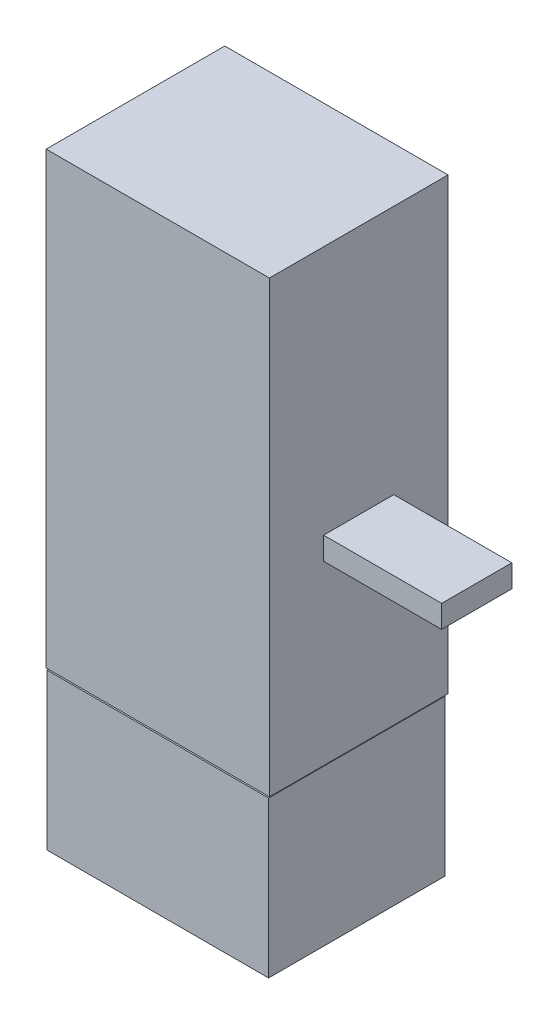
ISO-10303-21;
HEADER;
FILE_DESCRIPTION(('STEP AP214'),'2;1');
FILE_NAME('part.step','',(''),(''),'','','');
FILE_SCHEMA(('AUTOMOTIVE_DESIGN { 1 0 10303 214 1 1 1 1 }'));
ENDSEC;
DATA;
#1=APPLICATION_CONTEXT('core data for automotive mechanical design processes');
#2=APPLICATION_PROTOCOL_DEFINITION('international standard','automotive_design',2000,#1);
#3=PRODUCT_CONTEXT('',#1,'mechanical');
#4=PRODUCT('Part','Part','',(#3));
#5=PRODUCT_RELATED_PRODUCT_CATEGORY('part','',(#4));
#6=PRODUCT_DEFINITION_FORMATION('','',#4);
#7=PRODUCT_DEFINITION_CONTEXT('part definition',#1,'design');
#8=PRODUCT_DEFINITION('design','',#6,#7);
#9=PRODUCT_DEFINITION_SHAPE('','',#8);
#10=(LENGTH_UNIT() NAMED_UNIT(*) SI_UNIT(.MILLI.,.METRE.));
#11=(NAMED_UNIT(*) PLANE_ANGLE_UNIT() SI_UNIT($,.RADIAN.));
#12=(NAMED_UNIT(*) SI_UNIT($,.STERADIAN.) SOLID_ANGLE_UNIT());
#13=UNCERTAINTY_MEASURE_WITH_UNIT(LENGTH_MEASURE(1.E-05),#10,'distance_accuracy_value','');
#14=(GEOMETRIC_REPRESENTATION_CONTEXT(3) GLOBAL_UNCERTAINTY_ASSIGNED_CONTEXT((#13)) GLOBAL_UNIT_ASSIGNED_CONTEXT((#10,
#11,#12)) REPRESENTATION_CONTEXT('',''));
#15=CARTESIAN_POINT('',(0.,0.,0.));
#16=DIRECTION('',(0.,0.,1.));
#17=DIRECTION('',(1.,0.,0.));
#18=AXIS2_PLACEMENT_3D('',#15,#16,#17);
#19=CARTESIAN_POINT('',(747.965698242188,1133.51440429688,4609.51050721351));
#20=DIRECTION('',(-1.,0.,0.));
#21=DIRECTION('',(0.,0.,1.));
#22=AXIS2_PLACEMENT_3D('',#19,#20,#21);
#23=PLANE('',#22);
#24=DIRECTION('',(0.,0.,-1.));
#25=VECTOR('',#24,1.);
#26=CARTESIAN_POINT('',(747.965698242188,1133.51440429688,4609.51050721351));
#27=LINE('',#26,#25);
#28=CARTESIAN_POINT('',(747.965698242188,1133.51440429688,2390.));
#29=VERTEX_POINT('',#28);
#30=CARTESIAN_POINT('',(747.965698242188,1133.51440429688,1599.94));
#31=VERTEX_POINT('',#30);
#32=EDGE_CURVE('E181',#29,#31,#27,.T.);
#33=ORIENTED_EDGE('',*,*,#32,.F.);
#34=DIRECTION('',(0.,-1.,0.));
#35=VECTOR('',#34,1.);
#36=CARTESIAN_POINT('',(747.965698242188,1133.51440429688,2390.));
#37=LINE('',#36,#35);
#38=CARTESIAN_POINT('',(747.965698242188,-854.139282226562,2390.));
#39=VERTEX_POINT('',#38);
#40=EDGE_CURVE('E156',#29,#39,#37,.T.);
#41=ORIENTED_EDGE('',*,*,#40,.T.);
#42=DIRECTION('',(0.,0.,-1.));
#43=VECTOR('',#42,1.);
#44=CARTESIAN_POINT('',(747.965698242188,-854.139282226562,4609.51050721351));
#45=LINE('',#44,#43);
#46=CARTESIAN_POINT('',(747.965698242188,-854.139282226562,1599.94));
#47=VERTEX_POINT('',#46);
#48=EDGE_CURVE('E172',#39,#47,#45,.T.);
#49=ORIENTED_EDGE('',*,*,#48,.T.);
#50=DIRECTION('',(0.,1.,0.));
#51=VECTOR('',#50,1.);
#52=CARTESIAN_POINT('',(747.965698242188,1133.51440429688,1599.94));
#53=LINE('',#52,#51);
#54=EDGE_CURVE('E136',#47,#31,#53,.T.);
#55=ORIENTED_EDGE('',*,*,#54,.T.);
#56=EDGE_LOOP('',(#33,#41,#49,#55));
#57=FACE_BOUND('',#56,.T.);
#58=DIRECTION('',(0.,-1.,0.));
#59=VECTOR('',#58,1.);
#60=CARTESIAN_POINT('',(747.965698242188,1133.51440429688,2150.33762460566));
#61=LINE('',#60,#59);
#62=CARTESIAN_POINT('',(747.965698242188,28.5106049636239,2150.33762460566));
#63=VERTEX_POINT('',#62);
#64=CARTESIAN_POINT('',(747.965698242188,-71.3554303362016,2150.33762460566));
#65=VERTEX_POINT('',#64);
#66=EDGE_CURVE('E12',#63,#65,#61,.T.);
#67=ORIENTED_EDGE('',*,*,#66,.F.);
#68=DIRECTION('',(0.,0.,1.));
#69=VECTOR('',#68,1.);
#70=CARTESIAN_POINT('',(747.965698242188,28.5106049636239,4609.51050721351));
#71=LINE('',#70,#69);
#72=CARTESIAN_POINT('',(747.965698242188,28.5106049636239,1839.88451486924));
#73=VERTEX_POINT('',#72);
#74=EDGE_CURVE('E159',#73,#63,#71,.T.);
#75=ORIENTED_EDGE('',*,*,#74,.F.);
#76=DIRECTION('',(0.,1.,0.));
#77=VECTOR('',#76,1.);
#78=CARTESIAN_POINT('',(747.965698242188,1133.51440429688,1839.88451486924));
#79=LINE('',#78,#77);
#80=CARTESIAN_POINT('',(747.965698242188,-71.3554303362016,1839.88451486924));
#81=VERTEX_POINT('',#80);
#82=EDGE_CURVE('E69',#81,#73,#79,.T.);
#83=ORIENTED_EDGE('',*,*,#82,.F.);
#84=DIRECTION('',(0.,0.,-1.));
#85=VECTOR('',#84,1.);
#86=CARTESIAN_POINT('',(747.965698242188,-71.3554303362016,4609.51050721351));
#87=LINE('',#86,#85);
#88=EDGE_CURVE('E59',#65,#81,#87,.T.);
#89=ORIENTED_EDGE('',*,*,#88,.F.);
#90=EDGE_LOOP('',(#67,#75,#83,#89));
#91=FACE_BOUND('',#90,.T.);
#92=ADVANCED_FACE('F51',(#57,#91),#23,.F.);
#93=CARTESIAN_POINT('',(0.,0.,1599.94));
#94=DIRECTION('',(0.,0.,-1.));
#95=DIRECTION('',(-1.,0.,0.));
#96=AXIS2_PLACEMENT_3D('',#93,#94,#95);
#97=PLANE('',#96);
#98=ORIENTED_EDGE('',*,*,#54,.F.);
#99=DIRECTION('',(1.,0.,0.));
#100=VECTOR('',#99,1.);
#101=CARTESIAN_POINT('',(747.965698242188,-854.139282226562,1599.94));
#102=LINE('',#101,#100);
#103=CARTESIAN_POINT('',(-239.687942504883,-854.139282226562,1599.94));
#104=VERTEX_POINT('',#103);
#105=EDGE_CURVE('E168',#104,#47,#102,.T.);
#106=ORIENTED_EDGE('',*,*,#105,.F.);
#107=DIRECTION('',(0.,-1.,0.));
#108=VECTOR('',#107,1.);
#109=CARTESIAN_POINT('',(-239.687942504883,1133.51440429688,1599.94));
#110=LINE('',#109,#108);
#111=CARTESIAN_POINT('',(-239.687942504883,1133.51440429688,1599.94));
#112=VERTEX_POINT('',#111);
#113=EDGE_CURVE('E164',#112,#104,#110,.T.);
#114=ORIENTED_EDGE('',*,*,#113,.F.);
#115=DIRECTION('',(-1.,0.,0.));
#116=VECTOR('',#115,1.);
#117=CARTESIAN_POINT('',(747.965698242188,1133.51440429688,1599.94));
#118=LINE('',#117,#116);
#119=EDGE_CURVE('E141',#31,#112,#118,.T.);
#120=ORIENTED_EDGE('',*,*,#119,.F.);
#121=EDGE_LOOP('',(#98,#106,#114,#120));
#122=FACE_BOUND('',#121,.T.);
#123=ADVANCED_FACE('F207',(#122),#97,.T.);
#124=CARTESIAN_POINT('',(747.965698242188,-854.139282226562,4609.51050721351));
#125=DIRECTION('',(0.,1.,0.));
#126=DIRECTION('',(0.,0.,1.));
#127=AXIS2_PLACEMENT_3D('',#124,#125,#126);
#128=PLANE('',#127);
#129=ORIENTED_EDGE('',*,*,#48,.F.);
#130=DIRECTION('',(-1.,0.,0.));
#131=VECTOR('',#130,1.);
#132=CARTESIAN_POINT('',(747.965698242188,-854.139282226562,2390.));
#133=LINE('',#132,#131);
#134=CARTESIAN_POINT('',(-239.687942504883,-854.139282226562,2390.));
#135=VERTEX_POINT('',#134);
#136=EDGE_CURVE('E152',#39,#135,#133,.T.);
#137=ORIENTED_EDGE('',*,*,#136,.T.);
#138=DIRECTION('',(0.,0.,-1.));
#139=VECTOR('',#138,1.);
#140=CARTESIAN_POINT('',(-239.687942504883,-854.139282226562,4609.51050721351));
#141=LINE('',#140,#139);
#142=EDGE_CURVE('E175',#135,#104,#141,.T.);
#143=ORIENTED_EDGE('',*,*,#142,.T.);
#144=ORIENTED_EDGE('',*,*,#105,.T.);
#145=EDGE_LOOP('',(#129,#137,#143,#144));
#146=FACE_BOUND('',#145,.T.);
#147=ADVANCED_FACE('F214',(#146),#128,.F.);
#148=CARTESIAN_POINT('',(-239.687942504883,1133.51440429688,4609.51050721351));
#149=DIRECTION('',(1.,0.,0.));
#150=DIRECTION('',(0.,0.,-1.));
#151=AXIS2_PLACEMENT_3D('',#148,#149,#150);
#152=PLANE('',#151);
#153=ORIENTED_EDGE('',*,*,#142,.F.);
#154=DIRECTION('',(0.,1.,0.));
#155=VECTOR('',#154,1.);
#156=CARTESIAN_POINT('',(-239.687942504883,1133.51440429688,2390.));
#157=LINE('',#156,#155);
#158=CARTESIAN_POINT('',(-239.687942504883,1133.51440429688,2390.));
#159=VERTEX_POINT('',#158);
#160=EDGE_CURVE('E147',#135,#159,#157,.T.);
#161=ORIENTED_EDGE('',*,*,#160,.T.);
#162=DIRECTION('',(0.,0.,-1.));
#163=VECTOR('',#162,1.);
#164=CARTESIAN_POINT('',(-239.687942504883,1133.51440429688,4609.51050721351));
#165=LINE('',#164,#163);
#166=EDGE_CURVE('E178',#159,#112,#165,.T.);
#167=ORIENTED_EDGE('',*,*,#166,.T.);
#168=ORIENTED_EDGE('',*,*,#113,.T.);
#169=EDGE_LOOP('',(#153,#161,#167,#168));
#170=FACE_BOUND('',#169,.T.);
#171=ADVANCED_FACE('F231',(#170),#152,.F.);
#172=CARTESIAN_POINT('',(747.965698242188,1133.51440429688,4609.51050721351));
#173=DIRECTION('',(0.,-1.,0.));
#174=DIRECTION('',(0.,0.,-1.));
#175=AXIS2_PLACEMENT_3D('',#172,#173,#174);
#176=PLANE('',#175);
#177=ORIENTED_EDGE('',*,*,#166,.F.);
#178=DIRECTION('',(1.,0.,0.));
#179=VECTOR('',#178,1.);
#180=CARTESIAN_POINT('',(747.965698242188,1133.51440429688,2390.));
#181=LINE('',#180,#179);
#182=EDGE_CURVE('E151',#159,#29,#181,.T.);
#183=ORIENTED_EDGE('',*,*,#182,.T.);
#184=ORIENTED_EDGE('',*,*,#32,.T.);
#185=ORIENTED_EDGE('',*,*,#119,.T.);
#186=EDGE_LOOP('',(#177,#183,#184,#185));
#187=FACE_BOUND('',#186,.T.);
#188=ADVANCED_FACE('F223',(#187),#176,.F.);
#189=CARTESIAN_POINT('',(-235.861114501953,-860.69,2390.));
#190=DIRECTION('',(0.,0.,-1.));
#191=DIRECTION('',(-1.,0.,0.));
#192=AXIS2_PLACEMENT_3D('',#189,#190,#191);
#193=PLANE('',#192);
#194=ORIENTED_EDGE('',*,*,#182,.F.);
#195=ORIENTED_EDGE('',*,*,#160,.F.);
#196=ORIENTED_EDGE('',*,*,#136,.F.);
#197=ORIENTED_EDGE('',*,*,#40,.F.);
#198=EDGE_LOOP('',(#194,#195,#196,#197));
#199=FACE_BOUND('',#198,.T.);
#200=ADVANCED_FACE('F225',(#199),#193,.F.);
#201=CARTESIAN_POINT('',(1270.13891601562,28.5106049636239,2150.33762460566));
#202=DIRECTION('',(0.,0.,-1.));
#203=DIRECTION('',(-1.,0.,0.));
#204=AXIS2_PLACEMENT_3D('',#201,#202,#203);
#205=PLANE('',#204);
#206=DIRECTION('',(-1.,0.,0.));
#207=VECTOR('',#206,1.);
#208=CARTESIAN_POINT('',(1270.13891601562,28.5106049636239,2150.33762460566));
#209=LINE('',#208,#207);
#210=CARTESIAN_POINT('',(1270.13891601562,28.5106049636239,2150.33762460566));
#211=VERTEX_POINT('',#210);
#212=EDGE_CURVE('E199',#211,#63,#209,.T.);
#213=ORIENTED_EDGE('',*,*,#212,.T.);
#214=ORIENTED_EDGE('',*,*,#66,.T.);
#215=DIRECTION('',(-1.,0.,0.));
#216=VECTOR('',#215,1.);
#217=CARTESIAN_POINT('',(1270.13891601562,-71.3554303362015,2150.33762460566));
#218=LINE('',#217,#216);
#219=CARTESIAN_POINT('',(1270.13891601562,-71.3554303362015,2150.33762460566));
#220=VERTEX_POINT('',#219);
#221=EDGE_CURVE('E116',#220,#65,#218,.T.);
#222=ORIENTED_EDGE('',*,*,#221,.F.);
#223=DIRECTION('',(0.,-1.,0.));
#224=VECTOR('',#223,1.);
#225=CARTESIAN_POINT('',(1270.13891601562,28.5106049636239,2150.33762460566));
#226=LINE('',#225,#224);
#227=EDGE_CURVE('E123',#211,#220,#226,.T.);
#228=ORIENTED_EDGE('',*,*,#227,.F.);
#229=EDGE_LOOP('',(#213,#214,#222,#228));
#230=FACE_BOUND('',#229,.T.);
#231=ADVANCED_FACE('F134',(#230),#205,.F.);
#232=CARTESIAN_POINT('',(1270.13891601562,-71.3554303362015,2150.33762460566));
#233=DIRECTION('',(0.,1.,0.));
#234=DIRECTION('',(0.,0.,1.));
#235=AXIS2_PLACEMENT_3D('',#232,#233,#234);
#236=PLANE('',#235);
#237=ORIENTED_EDGE('',*,*,#221,.T.);
#238=ORIENTED_EDGE('',*,*,#88,.T.);
#239=DIRECTION('',(-1.,0.,0.));
#240=VECTOR('',#239,1.);
#241=CARTESIAN_POINT('',(1270.13891601562,-71.3554303362015,1839.88451486924));
#242=LINE('',#241,#240);
#243=CARTESIAN_POINT('',(1270.13891601562,-71.3554303362015,1839.88451486924));
#244=VERTEX_POINT('',#243);
#245=EDGE_CURVE('E118',#244,#81,#242,.T.);
#246=ORIENTED_EDGE('',*,*,#245,.F.);
#247=DIRECTION('',(0.,0.,-1.));
#248=VECTOR('',#247,1.);
#249=CARTESIAN_POINT('',(1270.13891601562,-71.3554303362015,2150.33762460566));
#250=LINE('',#249,#248);
#251=EDGE_CURVE('E112',#220,#244,#250,.T.);
#252=ORIENTED_EDGE('',*,*,#251,.F.);
#253=EDGE_LOOP('',(#237,#238,#246,#252));
#254=FACE_BOUND('',#253,.T.);
#255=ADVANCED_FACE('F114',(#254),#236,.F.);
#256=CARTESIAN_POINT('',(1270.13891601562,28.5106049636239,1839.88451486924));
#257=DIRECTION('',(0.,0.,1.));
#258=DIRECTION('',(1.,0.,0.));
#259=AXIS2_PLACEMENT_3D('',#256,#257,#258);
#260=PLANE('',#259);
#261=ORIENTED_EDGE('',*,*,#245,.T.);
#262=ORIENTED_EDGE('',*,*,#82,.T.);
#263=DIRECTION('',(-1.,0.,0.));
#264=VECTOR('',#263,1.);
#265=CARTESIAN_POINT('',(1270.13891601562,28.5106049636239,1839.88451486924));
#266=LINE('',#265,#264);
#267=CARTESIAN_POINT('',(1270.13891601562,28.5106049636239,1839.88451486924));
#268=VERTEX_POINT('',#267);
#269=EDGE_CURVE('E143',#268,#73,#266,.T.);
#270=ORIENTED_EDGE('',*,*,#269,.F.);
#271=DIRECTION('',(0.,1.,0.));
#272=VECTOR('',#271,1.);
#273=CARTESIAN_POINT('',(1270.13891601562,28.5106049636239,1839.88451486924));
#274=LINE('',#273,#272);
#275=EDGE_CURVE('E122',#244,#268,#274,.T.);
#276=ORIENTED_EDGE('',*,*,#275,.F.);
#277=EDGE_LOOP('',(#261,#262,#270,#276));
#278=FACE_BOUND('',#277,.T.);
#279=ADVANCED_FACE('F193',(#278),#260,.F.);
#280=CARTESIAN_POINT('',(1270.13891601562,28.5106049636239,2150.33762460566));
#281=DIRECTION('',(0.,-1.,0.));
#282=DIRECTION('',(0.,0.,-1.));
#283=AXIS2_PLACEMENT_3D('',#280,#281,#282);
#284=PLANE('',#283);
#285=ORIENTED_EDGE('',*,*,#269,.T.);
#286=ORIENTED_EDGE('',*,*,#74,.T.);
#287=ORIENTED_EDGE('',*,*,#212,.F.);
#288=DIRECTION('',(0.,0.,1.));
#289=VECTOR('',#288,1.);
#290=CARTESIAN_POINT('',(1270.13891601562,28.5106049636239,2150.33762460566));
#291=LINE('',#290,#289);
#292=EDGE_CURVE('E128',#268,#211,#291,.T.);
#293=ORIENTED_EDGE('',*,*,#292,.F.);
#294=EDGE_LOOP('',(#285,#286,#287,#293));
#295=FACE_BOUND('',#294,.T.);
#296=ADVANCED_FACE('F205',(#295),#284,.F.);
#297=CARTESIAN_POINT('',(1270.13891601562,0.,0.));
#298=DIRECTION('',(1.,0.,0.));
#299=DIRECTION('',(0.,0.,-1.));
#300=AXIS2_PLACEMENT_3D('',#297,#298,#299);
#301=PLANE('',#300);
#302=ORIENTED_EDGE('',*,*,#227,.T.);
#303=ORIENTED_EDGE('',*,*,#251,.T.);
#304=ORIENTED_EDGE('',*,*,#275,.T.);
#305=ORIENTED_EDGE('',*,*,#292,.T.);
#306=EDGE_LOOP('',(#302,#303,#304,#305));
#307=FACE_BOUND('',#306,.T.);
#308=ADVANCED_FACE('F126',(#307),#301,.T.);
#309=CLOSED_SHELL('',(#92,#123,#147,#171,#188,#200,#231,#255,#279,#296,#308));
#310=MANIFOLD_SOLID_BREP('B2',#309);
#311=CARTESIAN_POINT('',(-235.861114501953,-860.69,1610.));
#312=DIRECTION('',(1.,0.,0.));
#313=DIRECTION('',(0.,0.,-1.));
#314=AXIS2_PLACEMENT_3D('',#311,#312,#313);
#315=PLANE('',#314);
#316=DIRECTION('',(0.,0.,1.));
#317=VECTOR('',#316,1.);
#318=CARTESIAN_POINT('',(-235.861114501953,-1550.,1610.));
#319=LINE('',#318,#317);
#320=CARTESIAN_POINT('',(-235.861114501953,-1550.,1610.));
#321=VERTEX_POINT('',#320);
#322=CARTESIAN_POINT('',(-235.861114501953,-1550.,2390.));
#323=VERTEX_POINT('',#322);
#324=EDGE_CURVE('E376',#321,#323,#319,.T.);
#325=ORIENTED_EDGE('',*,*,#324,.T.);
#326=DIRECTION('',(0.,-1.,0.));
#327=VECTOR('',#326,1.);
#328=CARTESIAN_POINT('',(-235.861114501953,-860.69,2390.));
#329=LINE('',#328,#327);
#330=CARTESIAN_POINT('',(-235.861114501953,-860.69,2390.));
#331=VERTEX_POINT('',#330);
#332=EDGE_CURVE('E49',#331,#323,#329,.T.);
#333=ORIENTED_EDGE('',*,*,#332,.F.);
#334=DIRECTION('',(0.,0.,1.));
#335=VECTOR('',#334,1.);
#336=CARTESIAN_POINT('',(-235.861114501953,-860.69,1610.));
#337=LINE('',#336,#335);
#338=CARTESIAN_POINT('',(-235.861114501953,-860.69,1610.));
#339=VERTEX_POINT('',#338);
#340=EDGE_CURVE('E364',#339,#331,#337,.T.);
#341=ORIENTED_EDGE('',*,*,#340,.F.);
#342=DIRECTION('',(0.,-1.,0.));
#343=VECTOR('',#342,1.);
#344=CARTESIAN_POINT('',(-235.861114501953,-860.69,1610.));
#345=LINE('',#344,#343);
#346=EDGE_CURVE('E372',#339,#321,#345,.T.);
#347=ORIENTED_EDGE('',*,*,#346,.T.);
#348=EDGE_LOOP('',(#325,#333,#341,#347));
#349=FACE_BOUND('',#348,.T.);
#350=ADVANCED_FACE('F313',(#349),#315,.F.);
#351=CARTESIAN_POINT('',(-235.861114501953,-860.69,2390.));
#352=DIRECTION('',(0.,0.,-1.));
#353=DIRECTION('',(-1.,0.,0.));
#354=AXIS2_PLACEMENT_3D('',#351,#352,#353);
#355=PLANE('',#354);
#356=DIRECTION('',(1.,0.,0.));
#357=VECTOR('',#356,1.);
#358=CARTESIAN_POINT('',(-235.861114501953,-1550.,2390.));
#359=LINE('',#358,#357);
#360=CARTESIAN_POINT('',(744.138916015625,-1550.,2390.));
#361=VERTEX_POINT('',#360);
#362=EDGE_CURVE('E368',#323,#361,#359,.T.);
#363=ORIENTED_EDGE('',*,*,#362,.T.);
#364=DIRECTION('',(0.,-1.,0.));
#365=VECTOR('',#364,1.);
#366=CARTESIAN_POINT('',(744.138916015625,-860.69,2390.));
#367=LINE('',#366,#365);
#368=CARTESIAN_POINT('',(744.138916015625,-860.69,2390.));
#369=VERTEX_POINT('',#368);
#370=EDGE_CURVE('E321',#369,#361,#367,.T.);
#371=ORIENTED_EDGE('',*,*,#370,.F.);
#372=DIRECTION('',(1.,0.,0.));
#373=VECTOR('',#372,1.);
#374=CARTESIAN_POINT('',(-235.861114501953,-860.69,2390.));
#375=LINE('',#374,#373);
#376=EDGE_CURVE('E359',#331,#369,#375,.T.);
#377=ORIENTED_EDGE('',*,*,#376,.F.);
#378=ORIENTED_EDGE('',*,*,#332,.T.);
#379=EDGE_LOOP('',(#363,#371,#377,#378));
#380=FACE_BOUND('',#379,.T.);
#381=ADVANCED_FACE('F367',(#380),#355,.F.);
#382=CARTESIAN_POINT('',(744.138916015625,-860.69,1610.));
#383=DIRECTION('',(-1.,0.,0.));
#384=DIRECTION('',(0.,0.,1.));
#385=AXIS2_PLACEMENT_3D('',#382,#383,#384);
#386=PLANE('',#385);
#387=DIRECTION('',(0.,0.,-1.));
#388=VECTOR('',#387,1.);
#389=CARTESIAN_POINT('',(744.138916015625,-1550.,1610.));
#390=LINE('',#389,#388);
#391=CARTESIAN_POINT('',(744.138916015625,-1550.,1610.));
#392=VERTEX_POINT('',#391);
#393=EDGE_CURVE('E346',#361,#392,#390,.T.);
#394=ORIENTED_EDGE('',*,*,#393,.T.);
#395=DIRECTION('',(0.,-1.,0.));
#396=VECTOR('',#395,1.);
#397=CARTESIAN_POINT('',(744.138916015625,-860.69,1610.));
#398=LINE('',#397,#396);
#399=CARTESIAN_POINT('',(744.138916015625,-860.69,1610.));
#400=VERTEX_POINT('',#399);
#401=EDGE_CURVE('E369',#400,#392,#398,.T.);
#402=ORIENTED_EDGE('',*,*,#401,.F.);
#403=DIRECTION('',(0.,0.,-1.));
#404=VECTOR('',#403,1.);
#405=CARTESIAN_POINT('',(744.138916015625,-860.69,1610.));
#406=LINE('',#405,#404);
#407=EDGE_CURVE('E362',#369,#400,#406,.T.);
#408=ORIENTED_EDGE('',*,*,#407,.F.);
#409=ORIENTED_EDGE('',*,*,#370,.T.);
#410=EDGE_LOOP('',(#394,#402,#408,#409));
#411=FACE_BOUND('',#410,.T.);
#412=ADVANCED_FACE('F370',(#411),#386,.F.);
#413=CARTESIAN_POINT('',(-235.861114501953,-860.69,1610.));
#414=DIRECTION('',(0.,0.,1.));
#415=DIRECTION('',(1.,0.,0.));
#416=AXIS2_PLACEMENT_3D('',#413,#414,#415);
#417=PLANE('',#416);
#418=DIRECTION('',(-1.,0.,0.));
#419=VECTOR('',#418,1.);
#420=CARTESIAN_POINT('',(-235.861114501953,-1550.,1610.));
#421=LINE('',#420,#419);
#422=EDGE_CURVE('E352',#392,#321,#421,.T.);
#423=ORIENTED_EDGE('',*,*,#422,.T.);
#424=ORIENTED_EDGE('',*,*,#346,.F.);
#425=DIRECTION('',(-1.,0.,0.));
#426=VECTOR('',#425,1.);
#427=CARTESIAN_POINT('',(-235.861114501953,-860.69,1610.));
#428=LINE('',#427,#426);
#429=EDGE_CURVE('E329',#400,#339,#428,.T.);
#430=ORIENTED_EDGE('',*,*,#429,.F.);
#431=ORIENTED_EDGE('',*,*,#401,.T.);
#432=EDGE_LOOP('',(#423,#424,#430,#431));
#433=FACE_BOUND('',#432,.T.);
#434=ADVANCED_FACE('F383',(#433),#417,.F.);
#435=CARTESIAN_POINT('',(0.,-860.69,0.));
#436=DIRECTION('',(0.,1.,0.));
#437=DIRECTION('',(0.,0.,1.));
#438=AXIS2_PLACEMENT_3D('',#435,#436,#437);
#439=PLANE('',#438);
#440=ORIENTED_EDGE('',*,*,#340,.T.);
#441=ORIENTED_EDGE('',*,*,#376,.T.);
#442=ORIENTED_EDGE('',*,*,#407,.T.);
#443=ORIENTED_EDGE('',*,*,#429,.T.);
#444=EDGE_LOOP('',(#440,#441,#442,#443));
#445=FACE_BOUND('',#444,.T.);
#446=ADVANCED_FACE('F360',(#445),#439,.T.);
#447=CARTESIAN_POINT('',(0.,-1550.,0.));
#448=DIRECTION('',(0.,1.,0.));
#449=DIRECTION('',(0.,0.,1.));
#450=AXIS2_PLACEMENT_3D('',#447,#448,#449);
#451=PLANE('',#450);
#452=ORIENTED_EDGE('',*,*,#324,.F.);
#453=ORIENTED_EDGE('',*,*,#422,.F.);
#454=ORIENTED_EDGE('',*,*,#393,.F.);
#455=ORIENTED_EDGE('',*,*,#362,.F.);
#456=EDGE_LOOP('',(#452,#453,#454,#455));
#457=FACE_BOUND('',#456,.T.);
#458=ADVANCED_FACE('F386',(#457),#451,.F.);
#459=CLOSED_SHELL('',(#350,#381,#412,#434,#446,#458));
#460=MANIFOLD_SOLID_BREP('B6',#459);
#461=ADVANCED_BREP_SHAPE_REPRESENTATION('',(#18,#310,#460),#14);
#462=SHAPE_DEFINITION_REPRESENTATION(#9,#461);
ENDSEC;
END-ISO-10303-21;
